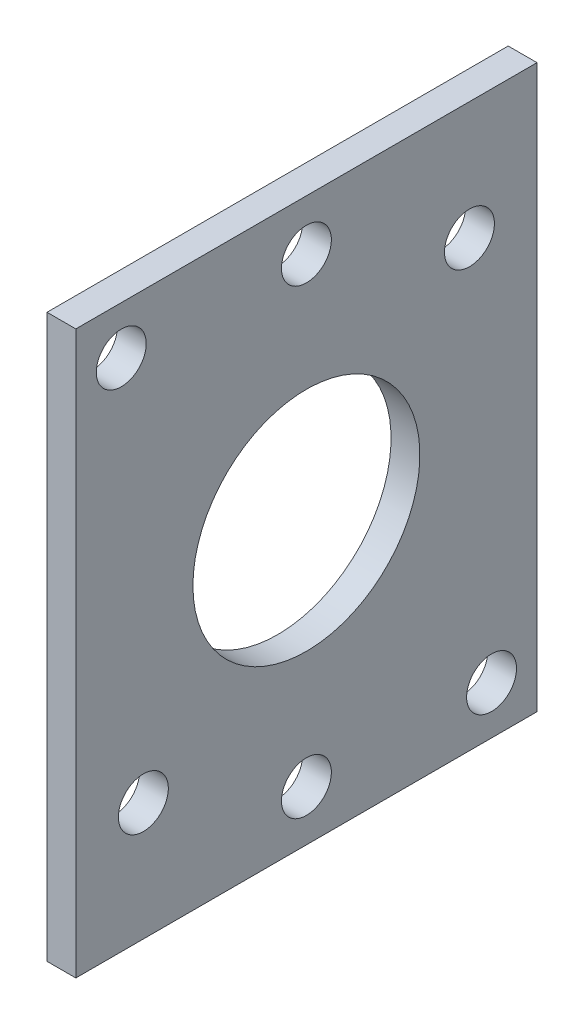
ISO-10303-21;
HEADER;
FILE_DESCRIPTION(('STEP AP214'),'2;1');
FILE_NAME('part.step','',(''),(''),'','','');
FILE_SCHEMA(('AUTOMOTIVE_DESIGN { 1 0 10303 214 1 1 1 1 }'));
ENDSEC;
DATA;
#1=APPLICATION_CONTEXT('core data for automotive mechanical design processes');
#2=APPLICATION_PROTOCOL_DEFINITION('international standard','automotive_design',2000,#1);
#3=PRODUCT_CONTEXT('',#1,'mechanical');
#4=PRODUCT('Part','Part','',(#3));
#5=PRODUCT_RELATED_PRODUCT_CATEGORY('part','',(#4));
#6=PRODUCT_DEFINITION_FORMATION('','',#4);
#7=PRODUCT_DEFINITION_CONTEXT('part definition',#1,'design');
#8=PRODUCT_DEFINITION('design','',#6,#7);
#9=PRODUCT_DEFINITION_SHAPE('','',#8);
#10=(LENGTH_UNIT() NAMED_UNIT(*) SI_UNIT(.MILLI.,.METRE.));
#11=(NAMED_UNIT(*) PLANE_ANGLE_UNIT() SI_UNIT($,.RADIAN.));
#12=(NAMED_UNIT(*) SI_UNIT($,.STERADIAN.) SOLID_ANGLE_UNIT());
#13=UNCERTAINTY_MEASURE_WITH_UNIT(LENGTH_MEASURE(1.E-05),#10,'distance_accuracy_value','');
#14=(GEOMETRIC_REPRESENTATION_CONTEXT(3) GLOBAL_UNCERTAINTY_ASSIGNED_CONTEXT((#13)) GLOBAL_UNIT_ASSIGNED_CONTEXT((#10,
#11,#12)) REPRESENTATION_CONTEXT('',''));
#15=CARTESIAN_POINT('',(0.,0.,0.));
#16=DIRECTION('',(0.,0.,1.));
#17=DIRECTION('',(1.,0.,0.));
#18=AXIS2_PLACEMENT_3D('',#15,#16,#17);
#19=CARTESIAN_POINT('',(3.175,0.,0.));
#20=DIRECTION('',(0.,0.,-1.));
#21=DIRECTION('',(-1.,0.,0.));
#22=AXIS2_PLACEMENT_3D('',#19,#20,#21);
#23=PLANE('',#22);
#24=DIRECTION('',(0.,-1.,0.));
#25=VECTOR('',#24,1.);
#26=CARTESIAN_POINT('',(0.,0.,0.));
#27=LINE('',#26,#25);
#28=CARTESIAN_POINT('',(0.,61.92,0.));
#29=VERTEX_POINT('',#28);
#30=CARTESIAN_POINT('',(0.,0.,0.));
#31=VERTEX_POINT('',#30);
#32=EDGE_CURVE('E102',#29,#31,#27,.T.);
#33=ORIENTED_EDGE('',*,*,#32,.T.);
#34=DIRECTION('',(-1.,0.,0.));
#35=VECTOR('',#34,1.);
#36=CARTESIAN_POINT('',(3.175,0.,0.));
#37=LINE('',#36,#35);
#38=CARTESIAN_POINT('',(3.175,0.,0.));
#39=VERTEX_POINT('',#38);
#40=EDGE_CURVE('E11',#39,#31,#37,.T.);
#41=ORIENTED_EDGE('',*,*,#40,.F.);
#42=DIRECTION('',(0.,-1.,0.));
#43=VECTOR('',#42,1.);
#44=CARTESIAN_POINT('',(3.175,0.,0.));
#45=LINE('',#44,#43);
#46=CARTESIAN_POINT('',(3.175,61.92,0.));
#47=VERTEX_POINT('',#46);
#48=EDGE_CURVE('E90',#47,#39,#45,.T.);
#49=ORIENTED_EDGE('',*,*,#48,.F.);
#50=DIRECTION('',(-1.,0.,0.));
#51=VECTOR('',#50,1.);
#52=CARTESIAN_POINT('',(3.175,61.92,0.));
#53=LINE('',#52,#51);
#54=EDGE_CURVE('E98',#47,#29,#53,.T.);
#55=ORIENTED_EDGE('',*,*,#54,.T.);
#56=EDGE_LOOP('',(#33,#41,#49,#55));
#57=FACE_BOUND('',#56,.T.);
#58=ADVANCED_FACE('F39',(#57),#23,.F.);
#59=CARTESIAN_POINT('',(3.175,0.,0.));
#60=DIRECTION('',(0.,1.,0.));
#61=DIRECTION('',(0.,0.,1.));
#62=AXIS2_PLACEMENT_3D('',#59,#60,#61);
#63=PLANE('',#62);
#64=DIRECTION('',(0.,0.,-1.));
#65=VECTOR('',#64,1.);
#66=CARTESIAN_POINT('',(0.,0.,0.));
#67=LINE('',#66,#65);
#68=CARTESIAN_POINT('',(0.,0.,-50.8));
#69=VERTEX_POINT('',#68);
#70=EDGE_CURVE('E94',#31,#69,#67,.T.);
#71=ORIENTED_EDGE('',*,*,#70,.T.);
#72=DIRECTION('',(-1.,0.,0.));
#73=VECTOR('',#72,1.);
#74=CARTESIAN_POINT('',(3.175,0.,-50.8));
#75=LINE('',#74,#73);
#76=CARTESIAN_POINT('',(3.175,0.,-50.8));
#77=VERTEX_POINT('',#76);
#78=EDGE_CURVE('E47',#77,#69,#75,.T.);
#79=ORIENTED_EDGE('',*,*,#78,.F.);
#80=DIRECTION('',(0.,0.,-1.));
#81=VECTOR('',#80,1.);
#82=CARTESIAN_POINT('',(3.175,0.,0.));
#83=LINE('',#82,#81);
#84=EDGE_CURVE('E85',#39,#77,#83,.T.);
#85=ORIENTED_EDGE('',*,*,#84,.F.);
#86=ORIENTED_EDGE('',*,*,#40,.T.);
#87=EDGE_LOOP('',(#71,#79,#85,#86));
#88=FACE_BOUND('',#87,.T.);
#89=ADVANCED_FACE('F93',(#88),#63,.F.);
#90=CARTESIAN_POINT('',(3.175,0.,-50.8));
#91=DIRECTION('',(0.,0.,1.));
#92=DIRECTION('',(1.,0.,0.));
#93=AXIS2_PLACEMENT_3D('',#90,#91,#92);
#94=PLANE('',#93);
#95=DIRECTION('',(0.,1.,0.));
#96=VECTOR('',#95,1.);
#97=CARTESIAN_POINT('',(0.,0.,-50.8));
#98=LINE('',#97,#96);
#99=CARTESIAN_POINT('',(0.,61.92,-50.8));
#100=VERTEX_POINT('',#99);
#101=EDGE_CURVE('E72',#69,#100,#98,.T.);
#102=ORIENTED_EDGE('',*,*,#101,.T.);
#103=DIRECTION('',(-1.,0.,0.));
#104=VECTOR('',#103,1.);
#105=CARTESIAN_POINT('',(3.175,61.92,-50.8));
#106=LINE('',#105,#104);
#107=CARTESIAN_POINT('',(3.175,61.92,-50.8));
#108=VERTEX_POINT('',#107);
#109=EDGE_CURVE('E95',#108,#100,#106,.T.);
#110=ORIENTED_EDGE('',*,*,#109,.F.);
#111=DIRECTION('',(0.,1.,0.));
#112=VECTOR('',#111,1.);
#113=CARTESIAN_POINT('',(3.175,0.,-50.8));
#114=LINE('',#113,#112);
#115=EDGE_CURVE('E88',#77,#108,#114,.T.);
#116=ORIENTED_EDGE('',*,*,#115,.F.);
#117=ORIENTED_EDGE('',*,*,#78,.T.);
#118=EDGE_LOOP('',(#102,#110,#116,#117));
#119=FACE_BOUND('',#118,.T.);
#120=ADVANCED_FACE('F96',(#119),#94,.F.);
#121=CARTESIAN_POINT('',(3.175,61.92,0.));
#122=DIRECTION('',(0.,-1.,0.));
#123=DIRECTION('',(0.,0.,-1.));
#124=AXIS2_PLACEMENT_3D('',#121,#122,#123);
#125=PLANE('',#124);
#126=DIRECTION('',(0.,0.,1.));
#127=VECTOR('',#126,1.);
#128=CARTESIAN_POINT('',(0.,61.92,0.));
#129=LINE('',#128,#127);
#130=EDGE_CURVE('E78',#100,#29,#129,.T.);
#131=ORIENTED_EDGE('',*,*,#130,.T.);
#132=ORIENTED_EDGE('',*,*,#54,.F.);
#133=DIRECTION('',(0.,0.,1.));
#134=VECTOR('',#133,1.);
#135=CARTESIAN_POINT('',(3.175,61.92,0.));
#136=LINE('',#135,#134);
#137=EDGE_CURVE('E55',#108,#47,#136,.T.);
#138=ORIENTED_EDGE('',*,*,#137,.F.);
#139=ORIENTED_EDGE('',*,*,#109,.T.);
#140=EDGE_LOOP('',(#131,#132,#138,#139));
#141=FACE_BOUND('',#140,.T.);
#142=ADVANCED_FACE('F110',(#141),#125,.F.);
#143=CARTESIAN_POINT('',(3.175,0.,0.));
#144=DIRECTION('',(-1.,0.,0.));
#145=DIRECTION('',(0.,0.,1.));
#146=AXIS2_PLACEMENT_3D('',#143,#144,#145);
#147=PLANE('',#146);
#148=CARTESIAN_POINT('',(3.175,48.9207559055118,-43.3599239801062));
#149=DIRECTION('',(-1.,0.,0.));
#150=DIRECTION('',(0.,0.,1.));
#151=AXIS2_PLACEMENT_3D('',#148,#149,#150);
#152=CIRCLE('',#151,2.75);
#153=CARTESIAN_POINT('',(3.175,48.9207559055118,-40.6099239801062));
#154=VERTEX_POINT('',#153);
#155=EDGE_CURVE('E141',#154,#154,#152,.T.);
#156=ORIENTED_EDGE('',*,*,#155,.T.);
#157=EDGE_LOOP('',(#156));
#158=FACE_BOUND('',#157,.T.);
#159=CARTESIAN_POINT('',(3.175,56.6480871347203,-5.00450452609221));
#160=DIRECTION('',(-1.,0.,0.));
#161=DIRECTION('',(0.,0.,1.));
#162=AXIS2_PLACEMENT_3D('',#159,#160,#161);
#163=CIRCLE('',#162,2.75);
#164=CARTESIAN_POINT('',(3.175,56.6480871347203,-2.25450452609221));
#165=VERTEX_POINT('',#164);
#166=EDGE_CURVE('E135',#165,#165,#163,.T.);
#167=ORIENTED_EDGE('',*,*,#166,.T.);
#168=EDGE_LOOP('',(#167));
#169=FACE_BOUND('',#168,.T.);
#170=CARTESIAN_POINT('',(3.175,13.0001827578616,-7.439487757862));
#171=DIRECTION('',(-1.,0.,0.));
#172=DIRECTION('',(0.,0.,1.));
#173=AXIS2_PLACEMENT_3D('',#170,#171,#172);
#174=CIRCLE('',#173,2.75);
#175=CARTESIAN_POINT('',(3.175,13.0001827578616,-4.689487757862));
#176=VERTEX_POINT('',#175);
#177=EDGE_CURVE('E129',#176,#176,#174,.T.);
#178=ORIENTED_EDGE('',*,*,#177,.T.);
#179=EDGE_LOOP('',(#178));
#180=FACE_BOUND('',#179,.T.);
#181=CARTESIAN_POINT('',(3.175,5.27247112124181,-45.7955093976272));
#182=DIRECTION('',(-1.,0.,0.));
#183=DIRECTION('',(0.,0.,1.));
#184=AXIS2_PLACEMENT_3D('',#181,#182,#183);
#185=CIRCLE('',#184,2.75);
#186=CARTESIAN_POINT('',(3.175,5.27247112124181,-43.0455093976272));
#187=VERTEX_POINT('',#186);
#188=EDGE_CURVE('E122',#187,#187,#185,.T.);
#189=ORIENTED_EDGE('',*,*,#188,.T.);
#190=EDGE_LOOP('',(#189));
#191=FACE_BOUND('',#190,.T.);
#192=CARTESIAN_POINT('',(3.175,5.56069499999992,-25.3996554046471));
#193=DIRECTION('',(-1.,0.,0.));
#194=DIRECTION('',(0.,0.,1.));
#195=AXIS2_PLACEMENT_3D('',#192,#193,#194);
#196=CIRCLE('',#195,2.75);
#197=CARTESIAN_POINT('',(3.175,5.56069499999992,-22.6496554046471));
#198=VERTEX_POINT('',#197);
#199=EDGE_CURVE('E152',#198,#198,#196,.T.);
#200=ORIENTED_EDGE('',*,*,#199,.T.);
#201=EDGE_LOOP('',(#200));
#202=FACE_BOUND('',#201,.T.);
#203=CARTESIAN_POINT('',(3.175,30.96,-25.3996554046471));
#204=DIRECTION('',(-1.,0.,0.));
#205=DIRECTION('',(0.,0.,1.));
#206=AXIS2_PLACEMENT_3D('',#203,#204,#205);
#207=CIRCLE('',#206,12.5);
#208=CARTESIAN_POINT('',(3.175,30.96,-12.8996554046471));
#209=VERTEX_POINT('',#208);
#210=EDGE_CURVE('E146',#209,#209,#207,.T.);
#211=ORIENTED_EDGE('',*,*,#210,.T.);
#212=EDGE_LOOP('',(#211));
#213=FACE_BOUND('',#212,.T.);
#214=CARTESIAN_POINT('',(3.175,56.36,-25.3996554046471));
#215=DIRECTION('',(-1.,0.,0.));
#216=DIRECTION('',(0.,0.,1.));
#217=AXIS2_PLACEMENT_3D('',#214,#215,#216);
#218=CIRCLE('',#217,2.74999999999999);
#219=CARTESIAN_POINT('',(3.175,56.36,-22.6496554046471));
#220=VERTEX_POINT('',#219);
#221=EDGE_CURVE('E105',#220,#220,#218,.T.);
#222=ORIENTED_EDGE('',*,*,#221,.T.);
#223=EDGE_LOOP('',(#222));
#224=FACE_BOUND('',#223,.T.);
#225=ORIENTED_EDGE('',*,*,#48,.T.);
#226=ORIENTED_EDGE('',*,*,#84,.T.);
#227=ORIENTED_EDGE('',*,*,#115,.T.);
#228=ORIENTED_EDGE('',*,*,#137,.T.);
#229=EDGE_LOOP('',(#225,#226,#227,#228));
#230=FACE_BOUND('',#229,.T.);
#231=ADVANCED_FACE('F86',(#158,#169,#180,#191,#202,#213,#224,#230),#147,.F.);
#232=CARTESIAN_POINT('',(0.,0.,0.));
#233=DIRECTION('',(-1.,0.,0.));
#234=DIRECTION('',(0.,0.,1.));
#235=AXIS2_PLACEMENT_3D('',#232,#233,#234);
#236=PLANE('',#235);
#237=CARTESIAN_POINT('',(0.,48.9207559055118,-43.3599239801062));
#238=DIRECTION('',(-1.,0.,0.));
#239=DIRECTION('',(0.,0.,1.));
#240=AXIS2_PLACEMENT_3D('',#237,#238,#239);
#241=CIRCLE('',#240,2.75);
#242=CARTESIAN_POINT('',(0.,48.9207559055118,-40.6099239801062));
#243=VERTEX_POINT('',#242);
#244=EDGE_CURVE('E119',#243,#243,#241,.T.);
#245=ORIENTED_EDGE('',*,*,#244,.F.);
#246=EDGE_LOOP('',(#245));
#247=FACE_BOUND('',#246,.T.);
#248=CARTESIAN_POINT('',(0.,56.6480871347203,-5.00450452609221));
#249=DIRECTION('',(-1.,0.,0.));
#250=DIRECTION('',(0.,0.,1.));
#251=AXIS2_PLACEMENT_3D('',#248,#249,#250);
#252=CIRCLE('',#251,2.75);
#253=CARTESIAN_POINT('',(0.,56.6480871347203,-2.25450452609221));
#254=VERTEX_POINT('',#253);
#255=EDGE_CURVE('E138',#254,#254,#252,.T.);
#256=ORIENTED_EDGE('',*,*,#255,.F.);
#257=EDGE_LOOP('',(#256));
#258=FACE_BOUND('',#257,.T.);
#259=CARTESIAN_POINT('',(0.,13.0001827578616,-7.439487757862));
#260=DIRECTION('',(-1.,0.,0.));
#261=DIRECTION('',(0.,0.,1.));
#262=AXIS2_PLACEMENT_3D('',#259,#260,#261);
#263=CIRCLE('',#262,2.75);
#264=CARTESIAN_POINT('',(0.,13.0001827578616,-4.689487757862));
#265=VERTEX_POINT('',#264);
#266=EDGE_CURVE('E132',#265,#265,#263,.T.);
#267=ORIENTED_EDGE('',*,*,#266,.F.);
#268=EDGE_LOOP('',(#267));
#269=FACE_BOUND('',#268,.T.);
#270=CARTESIAN_POINT('',(0.,5.27247112124181,-45.7955093976272));
#271=DIRECTION('',(-1.,0.,0.));
#272=DIRECTION('',(0.,0.,1.));
#273=AXIS2_PLACEMENT_3D('',#270,#271,#272);
#274=CIRCLE('',#273,2.75);
#275=CARTESIAN_POINT('',(0.,5.27247112124181,-43.0455093976272));
#276=VERTEX_POINT('',#275);
#277=EDGE_CURVE('E125',#276,#276,#274,.T.);
#278=ORIENTED_EDGE('',*,*,#277,.F.);
#279=EDGE_LOOP('',(#278));
#280=FACE_BOUND('',#279,.T.);
#281=CARTESIAN_POINT('',(0.,5.56069499999992,-25.3996554046471));
#282=DIRECTION('',(-1.,0.,0.));
#283=DIRECTION('',(0.,0.,1.));
#284=AXIS2_PLACEMENT_3D('',#281,#282,#283);
#285=CIRCLE('',#284,2.75);
#286=CARTESIAN_POINT('',(0.,5.56069499999992,-22.6496554046471));
#287=VERTEX_POINT('',#286);
#288=EDGE_CURVE('E126',#287,#287,#285,.T.);
#289=ORIENTED_EDGE('',*,*,#288,.F.);
#290=EDGE_LOOP('',(#289));
#291=FACE_BOUND('',#290,.T.);
#292=CARTESIAN_POINT('',(0.,30.96,-25.3996554046471));
#293=DIRECTION('',(-1.,0.,0.));
#294=DIRECTION('',(0.,0.,1.));
#295=AXIS2_PLACEMENT_3D('',#292,#293,#294);
#296=CIRCLE('',#295,12.5);
#297=CARTESIAN_POINT('',(0.,30.96,-12.8996554046471));
#298=VERTEX_POINT('',#297);
#299=EDGE_CURVE('E149',#298,#298,#296,.T.);
#300=ORIENTED_EDGE('',*,*,#299,.F.);
#301=EDGE_LOOP('',(#300));
#302=FACE_BOUND('',#301,.T.);
#303=CARTESIAN_POINT('',(0.,56.36,-25.3996554046471));
#304=DIRECTION('',(-1.,0.,0.));
#305=DIRECTION('',(0.,0.,1.));
#306=AXIS2_PLACEMENT_3D('',#303,#304,#305);
#307=CIRCLE('',#306,2.74999999999999);
#308=CARTESIAN_POINT('',(0.,56.36,-22.6496554046471));
#309=VERTEX_POINT('',#308);
#310=EDGE_CURVE('E116',#309,#309,#307,.T.);
#311=ORIENTED_EDGE('',*,*,#310,.F.);
#312=EDGE_LOOP('',(#311));
#313=FACE_BOUND('',#312,.T.);
#314=ORIENTED_EDGE('',*,*,#32,.F.);
#315=ORIENTED_EDGE('',*,*,#130,.F.);
#316=ORIENTED_EDGE('',*,*,#101,.F.);
#317=ORIENTED_EDGE('',*,*,#70,.F.);
#318=EDGE_LOOP('',(#314,#315,#316,#317));
#319=FACE_BOUND('',#318,.T.);
#320=ADVANCED_FACE('F113',(#247,#258,#269,#280,#291,#302,#313,#319),#236,.T.);
#321=CARTESIAN_POINT('',(3.175,56.36,-25.3996554046471));
#322=DIRECTION('',(-1.,0.,0.));
#323=DIRECTION('',(0.,0.,1.));
#324=AXIS2_PLACEMENT_3D('',#321,#322,#323);
#325=CYLINDRICAL_SURFACE('',#324,2.74999999999999);
#326=ORIENTED_EDGE('',*,*,#221,.F.);
#327=EDGE_LOOP('',(#326));
#328=FACE_BOUND('',#327,.T.);
#329=ORIENTED_EDGE('',*,*,#310,.T.);
#330=EDGE_LOOP('',(#329));
#331=FACE_BOUND('',#330,.T.);
#332=ADVANCED_FACE('F162',(#328,#331),#325,.F.);
#333=CARTESIAN_POINT('',(3.175,30.96,-25.3996554046471));
#334=DIRECTION('',(-1.,0.,0.));
#335=DIRECTION('',(0.,0.,1.));
#336=AXIS2_PLACEMENT_3D('',#333,#334,#335);
#337=CYLINDRICAL_SURFACE('',#336,12.5);
#338=ORIENTED_EDGE('',*,*,#210,.F.);
#339=EDGE_LOOP('',(#338));
#340=FACE_BOUND('',#339,.T.);
#341=ORIENTED_EDGE('',*,*,#299,.T.);
#342=EDGE_LOOP('',(#341));
#343=FACE_BOUND('',#342,.T.);
#344=ADVANCED_FACE('F170',(#340,#343),#337,.F.);
#345=CARTESIAN_POINT('',(3.175,5.56069499999992,-25.3996554046471));
#346=DIRECTION('',(-1.,0.,0.));
#347=DIRECTION('',(0.,0.,1.));
#348=AXIS2_PLACEMENT_3D('',#345,#346,#347);
#349=CYLINDRICAL_SURFACE('',#348,2.75);
#350=ORIENTED_EDGE('',*,*,#199,.F.);
#351=EDGE_LOOP('',(#350));
#352=FACE_BOUND('',#351,.T.);
#353=ORIENTED_EDGE('',*,*,#288,.T.);
#354=EDGE_LOOP('',(#353));
#355=FACE_BOUND('',#354,.T.);
#356=ADVANCED_FACE('F158',(#352,#355),#349,.F.);
#357=CARTESIAN_POINT('',(3.175,5.27247112124181,-45.7955093976272));
#358=DIRECTION('',(-1.,0.,0.));
#359=DIRECTION('',(0.,0.,1.));
#360=AXIS2_PLACEMENT_3D('',#357,#358,#359);
#361=CYLINDRICAL_SURFACE('',#360,2.75);
#362=ORIENTED_EDGE('',*,*,#188,.F.);
#363=EDGE_LOOP('',(#362));
#364=FACE_BOUND('',#363,.T.);
#365=ORIENTED_EDGE('',*,*,#277,.T.);
#366=EDGE_LOOP('',(#365));
#367=FACE_BOUND('',#366,.T.);
#368=ADVANCED_FACE('F210',(#364,#367),#361,.F.);
#369=CARTESIAN_POINT('',(3.175,13.0001827578616,-7.439487757862));
#370=DIRECTION('',(-1.,0.,0.));
#371=DIRECTION('',(0.,0.,1.));
#372=AXIS2_PLACEMENT_3D('',#369,#370,#371);
#373=CYLINDRICAL_SURFACE('',#372,2.75);
#374=ORIENTED_EDGE('',*,*,#177,.F.);
#375=EDGE_LOOP('',(#374));
#376=FACE_BOUND('',#375,.T.);
#377=ORIENTED_EDGE('',*,*,#266,.T.);
#378=EDGE_LOOP('',(#377));
#379=FACE_BOUND('',#378,.T.);
#380=ADVANCED_FACE('F215',(#376,#379),#373,.F.);
#381=CARTESIAN_POINT('',(3.175,56.6480871347203,-5.00450452609221));
#382=DIRECTION('',(-1.,0.,0.));
#383=DIRECTION('',(0.,0.,1.));
#384=AXIS2_PLACEMENT_3D('',#381,#382,#383);
#385=CYLINDRICAL_SURFACE('',#384,2.75);
#386=ORIENTED_EDGE('',*,*,#166,.F.);
#387=EDGE_LOOP('',(#386));
#388=FACE_BOUND('',#387,.T.);
#389=ORIENTED_EDGE('',*,*,#255,.T.);
#390=EDGE_LOOP('',(#389));
#391=FACE_BOUND('',#390,.T.);
#392=ADVANCED_FACE('F221',(#388,#391),#385,.F.);
#393=CARTESIAN_POINT('',(3.175,48.9207559055118,-43.3599239801062));
#394=DIRECTION('',(-1.,0.,0.));
#395=DIRECTION('',(0.,0.,1.));
#396=AXIS2_PLACEMENT_3D('',#393,#394,#395);
#397=CYLINDRICAL_SURFACE('',#396,2.75);
#398=ORIENTED_EDGE('',*,*,#155,.F.);
#399=EDGE_LOOP('',(#398));
#400=FACE_BOUND('',#399,.T.);
#401=ORIENTED_EDGE('',*,*,#244,.T.);
#402=EDGE_LOOP('',(#401));
#403=FACE_BOUND('',#402,.T.);
#404=ADVANCED_FACE('F218',(#400,#403),#397,.F.);
#405=CLOSED_SHELL('',(#58,#89,#120,#142,#231,#320,#332,#344,#356,#368,#380,#392,#404));
#406=MANIFOLD_SOLID_BREP('B2',#405);
#407=ADVANCED_BREP_SHAPE_REPRESENTATION('',(#18,#406),#14);
#408=SHAPE_DEFINITION_REPRESENTATION(#9,#407);
ENDSEC;
END-ISO-10303-21;
